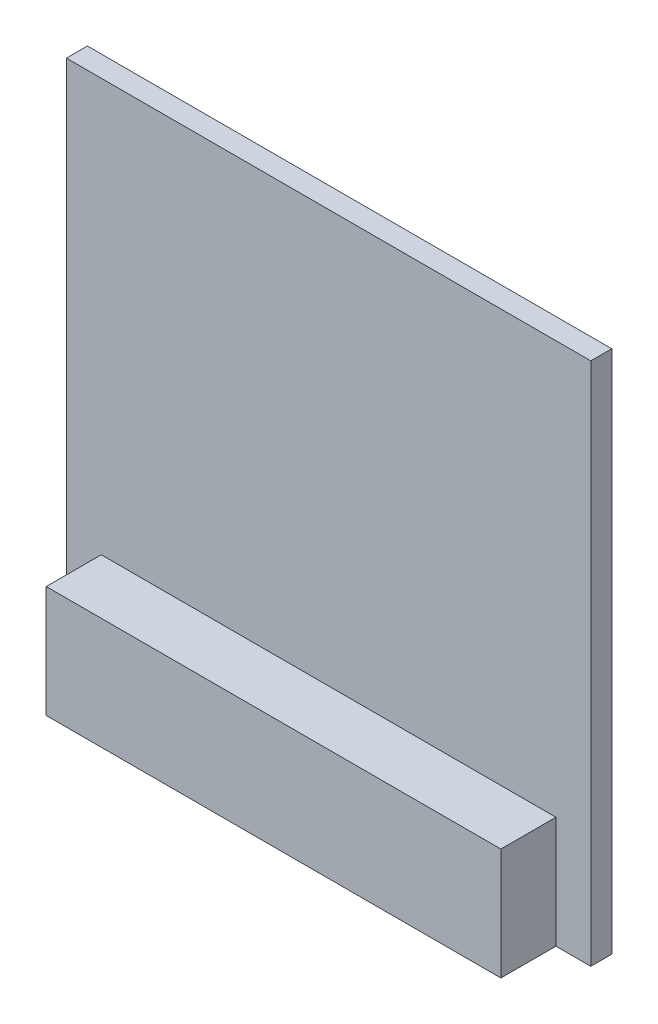
ISO-10303-21;
HEADER;
FILE_DESCRIPTION(('STEP AP214'),'2;1');
FILE_NAME('part.step','',(''),(''),'','','');
FILE_SCHEMA(('AUTOMOTIVE_DESIGN { 1 0 10303 214 1 1 1 1 }'));
ENDSEC;
DATA;
#1=APPLICATION_CONTEXT('core data for automotive mechanical design processes');
#2=APPLICATION_PROTOCOL_DEFINITION('international standard','automotive_design',2000,#1);
#3=PRODUCT_CONTEXT('',#1,'mechanical');
#4=PRODUCT('Part','Part','',(#3));
#5=PRODUCT_RELATED_PRODUCT_CATEGORY('part','',(#4));
#6=PRODUCT_DEFINITION_FORMATION('','',#4);
#7=PRODUCT_DEFINITION_CONTEXT('part definition',#1,'design');
#8=PRODUCT_DEFINITION('design','',#6,#7);
#9=PRODUCT_DEFINITION_SHAPE('','',#8);
#10=(LENGTH_UNIT() NAMED_UNIT(*) SI_UNIT(.MILLI.,.METRE.));
#11=(NAMED_UNIT(*) PLANE_ANGLE_UNIT() SI_UNIT($,.RADIAN.));
#12=(NAMED_UNIT(*) SI_UNIT($,.STERADIAN.) SOLID_ANGLE_UNIT());
#13=UNCERTAINTY_MEASURE_WITH_UNIT(LENGTH_MEASURE(1.E-05),#10,'distance_accuracy_value','');
#14=(GEOMETRIC_REPRESENTATION_CONTEXT(3) GLOBAL_UNCERTAINTY_ASSIGNED_CONTEXT((#13)) GLOBAL_UNIT_ASSIGNED_CONTEXT((#10,
#11,#12)) REPRESENTATION_CONTEXT('',''));
#15=CARTESIAN_POINT('',(0.,0.,0.));
#16=DIRECTION('',(0.,0.,1.));
#17=DIRECTION('',(1.,0.,0.));
#18=AXIS2_PLACEMENT_3D('',#15,#16,#17);
#19=CARTESIAN_POINT('',(0.,0.,0.));
#20=DIRECTION('',(0.,0.,-1.));
#21=DIRECTION('',(-1.,0.,0.));
#22=AXIS2_PLACEMENT_3D('',#19,#20,#21);
#23=PLANE('',#22);
#24=DIRECTION('',(0.,1.,0.));
#25=VECTOR('',#24,1.);
#26=CARTESIAN_POINT('',(12.7,-12.7,0.));
#27=LINE('',#26,#25);
#28=CARTESIAN_POINT('',(12.7,-12.7,0.));
#29=VERTEX_POINT('',#28);
#30=CARTESIAN_POINT('',(12.7,12.7,0.));
#31=VERTEX_POINT('',#30);
#32=EDGE_CURVE('E180',#29,#31,#27,.T.);
#33=ORIENTED_EDGE('',*,*,#32,.F.);
#34=DIRECTION('',(1.,0.,0.));
#35=VECTOR('',#34,1.);
#36=CARTESIAN_POINT('',(-12.7,-12.7,0.));
#37=LINE('',#36,#35);
#38=CARTESIAN_POINT('',(-12.7,-12.7,0.));
#39=VERTEX_POINT('',#38);
#40=EDGE_CURVE('E185',#39,#29,#37,.T.);
#41=ORIENTED_EDGE('',*,*,#40,.F.);
#42=DIRECTION('',(0.,-1.,0.));
#43=VECTOR('',#42,1.);
#44=CARTESIAN_POINT('',(-12.7,-12.7,0.));
#45=LINE('',#44,#43);
#46=CARTESIAN_POINT('',(-12.7,12.7,0.));
#47=VERTEX_POINT('',#46);
#48=EDGE_CURVE('E197',#47,#39,#45,.T.);
#49=ORIENTED_EDGE('',*,*,#48,.F.);
#50=DIRECTION('',(-1.,0.,0.));
#51=VECTOR('',#50,1.);
#52=CARTESIAN_POINT('',(-12.7,12.7,0.));
#53=LINE('',#52,#51);
#54=EDGE_CURVE('E195',#31,#47,#53,.T.);
#55=ORIENTED_EDGE('',*,*,#54,.F.);
#56=EDGE_LOOP('',(#33,#41,#49,#55));
#57=FACE_BOUND('',#56,.T.);
#58=DIRECTION('',(1.,0.,0.));
#59=VECTOR('',#58,1.);
#60=CARTESIAN_POINT('',(4.0132,0.508000000000007,0.));
#61=LINE('',#60,#59);
#62=CARTESIAN_POINT('',(-4.0132,0.508000000000007,0.));
#63=VERTEX_POINT('',#62);
#64=CARTESIAN_POINT('',(4.0132,0.508000000000007,0.));
#65=VERTEX_POINT('',#64);
#66=EDGE_CURVE('E363',#63,#65,#61,.T.);
#67=ORIENTED_EDGE('',*,*,#66,.F.);
#68=DIRECTION('',(0.,1.,0.));
#69=VECTOR('',#68,1.);
#70=CARTESIAN_POINT('',(-4.0132,-7.46759999999999,0.));
#71=LINE('',#70,#69);
#72=CARTESIAN_POINT('',(-4.0132,-7.46759999999999,0.));
#73=VERTEX_POINT('',#72);
#74=EDGE_CURVE('E147',#73,#63,#71,.T.);
#75=ORIENTED_EDGE('',*,*,#74,.F.);
#76=DIRECTION('',(-1.,0.,0.));
#77=VECTOR('',#76,1.);
#78=CARTESIAN_POINT('',(4.0132,-7.46759999999999,0.));
#79=LINE('',#78,#77);
#80=CARTESIAN_POINT('',(4.0132,-7.46759999999999,0.));
#81=VERTEX_POINT('',#80);
#82=EDGE_CURVE('E143',#81,#73,#79,.T.);
#83=ORIENTED_EDGE('',*,*,#82,.F.);
#84=DIRECTION('',(0.,-1.,0.));
#85=VECTOR('',#84,1.);
#86=CARTESIAN_POINT('',(4.0132,-7.46759999999999,0.));
#87=LINE('',#86,#85);
#88=EDGE_CURVE('E360',#65,#81,#87,.T.);
#89=ORIENTED_EDGE('',*,*,#88,.F.);
#90=EDGE_LOOP('',(#67,#75,#83,#89));
#91=FACE_BOUND('',#90,.T.);
#92=ADVANCED_FACE('F35',(#57,#91),#23,.T.);
#93=CARTESIAN_POINT('',(0.,0.,1.016));
#94=DIRECTION('',(0.,0.,-1.));
#95=DIRECTION('',(-1.,0.,0.));
#96=AXIS2_PLACEMENT_3D('',#93,#94,#95);
#97=PLANE('',#96);
#98=DIRECTION('',(0.,-1.,0.));
#99=VECTOR('',#98,1.);
#100=CARTESIAN_POINT('',(-11.0109,-12.7,1.016));
#101=LINE('',#100,#99);
#102=CARTESIAN_POINT('',(-11.0109,-7.2898,1.016));
#103=VERTEX_POINT('',#102);
#104=CARTESIAN_POINT('',(-11.0109,-12.7,1.016));
#105=VERTEX_POINT('',#104);
#106=EDGE_CURVE('E58',#103,#105,#101,.T.);
#107=ORIENTED_EDGE('',*,*,#106,.F.);
#108=DIRECTION('',(-1.,0.,0.));
#109=VECTOR('',#108,1.);
#110=CARTESIAN_POINT('',(-11.0109,-7.2898,1.016));
#111=LINE('',#110,#109);
#112=CARTESIAN_POINT('',(11.0109,-7.2898,1.016));
#113=VERTEX_POINT('',#112);
#114=EDGE_CURVE('E159',#113,#103,#111,.T.);
#115=ORIENTED_EDGE('',*,*,#114,.F.);
#116=DIRECTION('',(0.,1.,0.));
#117=VECTOR('',#116,1.);
#118=CARTESIAN_POINT('',(11.0109,-12.7,1.016));
#119=LINE('',#118,#117);
#120=CARTESIAN_POINT('',(11.0109,-12.7,1.016));
#121=VERTEX_POINT('',#120);
#122=EDGE_CURVE('E150',#121,#113,#119,.T.);
#123=ORIENTED_EDGE('',*,*,#122,.F.);
#124=DIRECTION('',(1.,0.,0.));
#125=VECTOR('',#124,1.);
#126=CARTESIAN_POINT('',(-12.7,-12.7,1.016));
#127=LINE('',#126,#125);
#128=CARTESIAN_POINT('',(12.7,-12.7,1.016));
#129=VERTEX_POINT('',#128);
#130=EDGE_CURVE('E189',#121,#129,#127,.T.);
#131=ORIENTED_EDGE('',*,*,#130,.T.);
#132=DIRECTION('',(0.,1.,0.));
#133=VECTOR('',#132,1.);
#134=CARTESIAN_POINT('',(12.7,-12.7,1.016));
#135=LINE('',#134,#133);
#136=CARTESIAN_POINT('',(12.7,12.7,1.016));
#137=VERTEX_POINT('',#136);
#138=EDGE_CURVE('E181',#129,#137,#135,.T.);
#139=ORIENTED_EDGE('',*,*,#138,.T.);
#140=DIRECTION('',(-1.,0.,0.));
#141=VECTOR('',#140,1.);
#142=CARTESIAN_POINT('',(-12.7,12.7,1.016));
#143=LINE('',#142,#141);
#144=CARTESIAN_POINT('',(-12.7,12.7,1.016));
#145=VERTEX_POINT('',#144);
#146=EDGE_CURVE('E184',#137,#145,#143,.T.);
#147=ORIENTED_EDGE('',*,*,#146,.T.);
#148=DIRECTION('',(0.,-1.,0.));
#149=VECTOR('',#148,1.);
#150=CARTESIAN_POINT('',(-12.7,-12.7,1.016));
#151=LINE('',#150,#149);
#152=CARTESIAN_POINT('',(-12.7,-12.7,1.016));
#153=VERTEX_POINT('',#152);
#154=EDGE_CURVE('E187',#145,#153,#151,.T.);
#155=ORIENTED_EDGE('',*,*,#154,.T.);
#156=EDGE_CURVE('E190',#153,#105,#127,.T.);
#157=ORIENTED_EDGE('',*,*,#156,.T.);
#158=EDGE_LOOP('',(#107,#115,#123,#131,#139,#147,#155,#157));
#159=FACE_BOUND('',#158,.T.);
#160=ADVANCED_FACE('F224',(#159),#97,.F.);
#161=CARTESIAN_POINT('',(12.7,-12.7,1.016));
#162=DIRECTION('',(-1.,0.,0.));
#163=DIRECTION('',(0.,0.,1.));
#164=AXIS2_PLACEMENT_3D('',#161,#162,#163);
#165=PLANE('',#164);
#166=ORIENTED_EDGE('',*,*,#32,.T.);
#167=DIRECTION('',(0.,0.,-1.));
#168=VECTOR('',#167,1.);
#169=CARTESIAN_POINT('',(12.7,12.7,1.016));
#170=LINE('',#169,#168);
#171=EDGE_CURVE('E11',#137,#31,#170,.T.);
#172=ORIENTED_EDGE('',*,*,#171,.F.);
#173=ORIENTED_EDGE('',*,*,#138,.F.);
#174=DIRECTION('',(0.,0.,-1.));
#175=VECTOR('',#174,1.);
#176=CARTESIAN_POINT('',(12.7,-12.7,1.016));
#177=LINE('',#176,#175);
#178=EDGE_CURVE('E192',#129,#29,#177,.T.);
#179=ORIENTED_EDGE('',*,*,#178,.T.);
#180=EDGE_LOOP('',(#166,#172,#173,#179));
#181=FACE_BOUND('',#180,.T.);
#182=ADVANCED_FACE('F37',(#181),#165,.F.);
#183=CARTESIAN_POINT('',(-12.7,12.7,1.016));
#184=DIRECTION('',(0.,-1.,0.));
#185=DIRECTION('',(0.,0.,-1.));
#186=AXIS2_PLACEMENT_3D('',#183,#184,#185);
#187=PLANE('',#186);
#188=ORIENTED_EDGE('',*,*,#54,.T.);
#189=DIRECTION('',(0.,0.,-1.));
#190=VECTOR('',#189,1.);
#191=CARTESIAN_POINT('',(-12.7,12.7,1.016));
#192=LINE('',#191,#190);
#193=EDGE_CURVE('E43',#145,#47,#192,.T.);
#194=ORIENTED_EDGE('',*,*,#193,.F.);
#195=ORIENTED_EDGE('',*,*,#146,.F.);
#196=ORIENTED_EDGE('',*,*,#171,.T.);
#197=EDGE_LOOP('',(#188,#194,#195,#196));
#198=FACE_BOUND('',#197,.T.);
#199=ADVANCED_FACE('F259',(#198),#187,.F.);
#200=CARTESIAN_POINT('',(-12.7,-12.7,1.016));
#201=DIRECTION('',(1.,0.,0.));
#202=DIRECTION('',(0.,0.,-1.));
#203=AXIS2_PLACEMENT_3D('',#200,#201,#202);
#204=PLANE('',#203);
#205=ORIENTED_EDGE('',*,*,#48,.T.);
#206=DIRECTION('',(0.,0.,-1.));
#207=VECTOR('',#206,1.);
#208=CARTESIAN_POINT('',(-12.7,-12.7,1.016));
#209=LINE('',#208,#207);
#210=EDGE_CURVE('E202',#153,#39,#209,.T.);
#211=ORIENTED_EDGE('',*,*,#210,.F.);
#212=ORIENTED_EDGE('',*,*,#154,.F.);
#213=ORIENTED_EDGE('',*,*,#193,.T.);
#214=EDGE_LOOP('',(#205,#211,#212,#213));
#215=FACE_BOUND('',#214,.T.);
#216=ADVANCED_FACE('F209',(#215),#204,.F.);
#217=CARTESIAN_POINT('',(-12.7,-12.7,1.016));
#218=DIRECTION('',(0.,1.,0.));
#219=DIRECTION('',(0.,0.,1.));
#220=AXIS2_PLACEMENT_3D('',#217,#218,#219);
#221=PLANE('',#220);
#222=ORIENTED_EDGE('',*,*,#40,.T.);
#223=ORIENTED_EDGE('',*,*,#178,.F.);
#224=ORIENTED_EDGE('',*,*,#130,.F.);
#225=DIRECTION('',(0.,0.,-1.));
#226=VECTOR('',#225,1.);
#227=CARTESIAN_POINT('',(11.0109,-12.7,3.683));
#228=LINE('',#227,#226);
#229=CARTESIAN_POINT('',(11.0109,-12.7,3.683));
#230=VERTEX_POINT('',#229);
#231=EDGE_CURVE('E174',#230,#121,#228,.T.);
#232=ORIENTED_EDGE('',*,*,#231,.F.);
#233=DIRECTION('',(1.,0.,0.));
#234=VECTOR('',#233,1.);
#235=CARTESIAN_POINT('',(-11.0109,-12.7,3.683));
#236=LINE('',#235,#234);
#237=CARTESIAN_POINT('',(-11.0109,-12.7,3.683));
#238=VERTEX_POINT('',#237);
#239=EDGE_CURVE('E158',#238,#230,#236,.T.);
#240=ORIENTED_EDGE('',*,*,#239,.F.);
#241=DIRECTION('',(0.,0.,-1.));
#242=VECTOR('',#241,1.);
#243=CARTESIAN_POINT('',(-11.0109,-12.7,3.683));
#244=LINE('',#243,#242);
#245=EDGE_CURVE('E177',#238,#105,#244,.T.);
#246=ORIENTED_EDGE('',*,*,#245,.T.);
#247=ORIENTED_EDGE('',*,*,#156,.F.);
#248=ORIENTED_EDGE('',*,*,#210,.T.);
#249=EDGE_LOOP('',(#222,#223,#224,#232,#240,#246,#247,#248));
#250=FACE_BOUND('',#249,.T.);
#251=ADVANCED_FACE('F218',(#250),#221,.F.);
#252=CARTESIAN_POINT('',(-11.0109,-12.7,3.683));
#253=DIRECTION('',(1.,0.,0.));
#254=DIRECTION('',(0.,0.,-1.));
#255=AXIS2_PLACEMENT_3D('',#252,#253,#254);
#256=PLANE('',#255);
#257=ORIENTED_EDGE('',*,*,#106,.T.);
#258=ORIENTED_EDGE('',*,*,#245,.F.);
#259=DIRECTION('',(0.,-1.,0.));
#260=VECTOR('',#259,1.);
#261=CARTESIAN_POINT('',(-11.0109,-12.7,3.683));
#262=LINE('',#261,#260);
#263=CARTESIAN_POINT('',(-11.0109,-7.2898,3.683));
#264=VERTEX_POINT('',#263);
#265=EDGE_CURVE('E155',#264,#238,#262,.T.);
#266=ORIENTED_EDGE('',*,*,#265,.F.);
#267=DIRECTION('',(0.,0.,-1.));
#268=VECTOR('',#267,1.);
#269=CARTESIAN_POINT('',(-11.0109,-7.2898,3.683));
#270=LINE('',#269,#268);
#271=EDGE_CURVE('E164',#264,#103,#270,.T.);
#272=ORIENTED_EDGE('',*,*,#271,.T.);
#273=EDGE_LOOP('',(#257,#258,#266,#272));
#274=FACE_BOUND('',#273,.T.);
#275=ADVANCED_FACE('F237',(#274),#256,.F.);
#276=CARTESIAN_POINT('',(11.0109,-12.7,3.683));
#277=DIRECTION('',(-1.,0.,0.));
#278=DIRECTION('',(0.,0.,1.));
#279=AXIS2_PLACEMENT_3D('',#276,#277,#278);
#280=PLANE('',#279);
#281=ORIENTED_EDGE('',*,*,#122,.T.);
#282=DIRECTION('',(0.,0.,-1.));
#283=VECTOR('',#282,1.);
#284=CARTESIAN_POINT('',(11.0109,-7.2898,3.683));
#285=LINE('',#284,#283);
#286=CARTESIAN_POINT('',(11.0109,-7.2898,3.683));
#287=VERTEX_POINT('',#286);
#288=EDGE_CURVE('E171',#287,#113,#285,.T.);
#289=ORIENTED_EDGE('',*,*,#288,.F.);
#290=DIRECTION('',(0.,1.,0.));
#291=VECTOR('',#290,1.);
#292=CARTESIAN_POINT('',(11.0109,-12.7,3.683));
#293=LINE('',#292,#291);
#294=EDGE_CURVE('E161',#230,#287,#293,.T.);
#295=ORIENTED_EDGE('',*,*,#294,.F.);
#296=ORIENTED_EDGE('',*,*,#231,.T.);
#297=EDGE_LOOP('',(#281,#289,#295,#296));
#298=FACE_BOUND('',#297,.T.);
#299=ADVANCED_FACE('F228',(#298),#280,.F.);
#300=CARTESIAN_POINT('',(-11.0109,-7.2898,3.683));
#301=DIRECTION('',(0.,-1.,0.));
#302=DIRECTION('',(0.,0.,-1.));
#303=AXIS2_PLACEMENT_3D('',#300,#301,#302);
#304=PLANE('',#303);
#305=ORIENTED_EDGE('',*,*,#114,.T.);
#306=ORIENTED_EDGE('',*,*,#271,.F.);
#307=DIRECTION('',(-1.,0.,0.));
#308=VECTOR('',#307,1.);
#309=CARTESIAN_POINT('',(-11.0109,-7.2898,3.683));
#310=LINE('',#309,#308);
#311=EDGE_CURVE('E163',#287,#264,#310,.T.);
#312=ORIENTED_EDGE('',*,*,#311,.F.);
#313=ORIENTED_EDGE('',*,*,#288,.T.);
#314=EDGE_LOOP('',(#305,#306,#312,#313));
#315=FACE_BOUND('',#314,.T.);
#316=ADVANCED_FACE('F239',(#315),#304,.F.);
#317=CARTESIAN_POINT('',(0.,0.,3.683));
#318=DIRECTION('',(0.,0.,-1.));
#319=DIRECTION('',(-1.,0.,0.));
#320=AXIS2_PLACEMENT_3D('',#317,#318,#319);
#321=PLANE('',#320);
#322=ORIENTED_EDGE('',*,*,#265,.T.);
#323=ORIENTED_EDGE('',*,*,#239,.T.);
#324=ORIENTED_EDGE('',*,*,#294,.T.);
#325=ORIENTED_EDGE('',*,*,#311,.T.);
#326=EDGE_LOOP('',(#322,#323,#324,#325));
#327=FACE_BOUND('',#326,.T.);
#328=ADVANCED_FACE('F232',(#327),#321,.F.);
#329=CARTESIAN_POINT('',(-4.0132,-7.46759999999999,-3.58902));
#330=DIRECTION('',(1.,0.,0.));
#331=DIRECTION('',(0.,0.,-1.));
#332=AXIS2_PLACEMENT_3D('',#329,#330,#331);
#333=PLANE('',#332);
#334=ORIENTED_EDGE('',*,*,#74,.T.);
#335=DIRECTION('',(0.,0.,1.));
#336=VECTOR('',#335,1.);
#337=CARTESIAN_POINT('',(-4.0132,0.508000000000007,-3.58902));
#338=LINE('',#337,#336);
#339=CARTESIAN_POINT('',(-4.0132,0.508000000000007,-3.58902));
#340=VERTEX_POINT('',#339);
#341=EDGE_CURVE('E128',#340,#63,#338,.T.);
#342=ORIENTED_EDGE('',*,*,#341,.F.);
#343=DIRECTION('',(0.,1.,0.));
#344=VECTOR('',#343,1.);
#345=CARTESIAN_POINT('',(-4.0132,-7.46759999999999,-3.58902));
#346=LINE('',#345,#344);
#347=CARTESIAN_POINT('',(-4.0132,-7.46759999999999,-3.58902));
#348=VERTEX_POINT('',#347);
#349=EDGE_CURVE('E135',#348,#340,#346,.T.);
#350=ORIENTED_EDGE('',*,*,#349,.F.);
#351=DIRECTION('',(0.,0.,1.));
#352=VECTOR('',#351,1.);
#353=CARTESIAN_POINT('',(-4.0132,-7.46759999999999,-3.58902));
#354=LINE('',#353,#352);
#355=EDGE_CURVE('E358',#348,#73,#354,.T.);
#356=ORIENTED_EDGE('',*,*,#355,.T.);
#357=EDGE_LOOP('',(#334,#342,#350,#356));
#358=FACE_BOUND('',#357,.T.);
#359=ADVANCED_FACE('F145',(#358),#333,.F.);
#360=CARTESIAN_POINT('',(4.0132,0.508000000000007,-3.58902));
#361=DIRECTION('',(0.,-1.,0.));
#362=DIRECTION('',(0.,0.,-1.));
#363=AXIS2_PLACEMENT_3D('',#360,#361,#362);
#364=PLANE('',#363);
#365=ORIENTED_EDGE('',*,*,#66,.T.);
#366=DIRECTION('',(0.,0.,1.));
#367=VECTOR('',#366,1.);
#368=CARTESIAN_POINT('',(4.0132,0.508000000000007,-3.58902));
#369=LINE('',#368,#367);
#370=CARTESIAN_POINT('',(4.0132,0.508000000000007,-3.58902));
#371=VERTEX_POINT('',#370);
#372=EDGE_CURVE('E131',#371,#65,#369,.T.);
#373=ORIENTED_EDGE('',*,*,#372,.F.);
#374=DIRECTION('',(1.,0.,0.));
#375=VECTOR('',#374,1.);
#376=CARTESIAN_POINT('',(4.0132,0.508000000000007,-3.58902));
#377=LINE('',#376,#375);
#378=EDGE_CURVE('E124',#340,#371,#377,.T.);
#379=ORIENTED_EDGE('',*,*,#378,.F.);
#380=ORIENTED_EDGE('',*,*,#341,.T.);
#381=EDGE_LOOP('',(#365,#373,#379,#380));
#382=FACE_BOUND('',#381,.T.);
#383=ADVANCED_FACE('F126',(#382),#364,.F.);
#384=CARTESIAN_POINT('',(4.0132,-7.46759999999999,-3.58902));
#385=DIRECTION('',(-1.,0.,0.));
#386=DIRECTION('',(0.,0.,1.));
#387=AXIS2_PLACEMENT_3D('',#384,#385,#386);
#388=PLANE('',#387);
#389=ORIENTED_EDGE('',*,*,#88,.T.);
#390=DIRECTION('',(0.,0.,1.));
#391=VECTOR('',#390,1.);
#392=CARTESIAN_POINT('',(4.0132,-7.46759999999999,-3.58902));
#393=LINE('',#392,#391);
#394=CARTESIAN_POINT('',(4.0132,-7.46759999999999,-3.58902));
#395=VERTEX_POINT('',#394);
#396=EDGE_CURVE('E50',#395,#81,#393,.T.);
#397=ORIENTED_EDGE('',*,*,#396,.F.);
#398=DIRECTION('',(0.,-1.,0.));
#399=VECTOR('',#398,1.);
#400=CARTESIAN_POINT('',(4.0132,-7.46759999999999,-3.58902));
#401=LINE('',#400,#399);
#402=EDGE_CURVE('E134',#371,#395,#401,.T.);
#403=ORIENTED_EDGE('',*,*,#402,.F.);
#404=ORIENTED_EDGE('',*,*,#372,.T.);
#405=EDGE_LOOP('',(#389,#397,#403,#404));
#406=FACE_BOUND('',#405,.T.);
#407=ADVANCED_FACE('F327',(#406),#388,.F.);
#408=CARTESIAN_POINT('',(4.0132,-7.46759999999999,-3.58902));
#409=DIRECTION('',(0.,1.,0.));
#410=DIRECTION('',(0.,0.,1.));
#411=AXIS2_PLACEMENT_3D('',#408,#409,#410);
#412=PLANE('',#411);
#413=ORIENTED_EDGE('',*,*,#82,.T.);
#414=ORIENTED_EDGE('',*,*,#355,.F.);
#415=DIRECTION('',(-1.,0.,0.));
#416=VECTOR('',#415,1.);
#417=CARTESIAN_POINT('',(4.0132,-7.46759999999999,-3.58902));
#418=LINE('',#417,#416);
#419=EDGE_CURVE('E139',#395,#348,#418,.T.);
#420=ORIENTED_EDGE('',*,*,#419,.F.);
#421=ORIENTED_EDGE('',*,*,#396,.T.);
#422=EDGE_LOOP('',(#413,#414,#420,#421));
#423=FACE_BOUND('',#422,.T.);
#424=ADVANCED_FACE('F336',(#423),#412,.F.);
#425=CARTESIAN_POINT('',(0.,0.,-3.58902));
#426=DIRECTION('',(0.,0.,1.));
#427=DIRECTION('',(1.,0.,0.));
#428=AXIS2_PLACEMENT_3D('',#425,#426,#427);
#429=PLANE('',#428);
#430=ORIENTED_EDGE('',*,*,#349,.T.);
#431=ORIENTED_EDGE('',*,*,#378,.T.);
#432=ORIENTED_EDGE('',*,*,#402,.T.);
#433=ORIENTED_EDGE('',*,*,#419,.T.);
#434=EDGE_LOOP('',(#430,#431,#432,#433));
#435=FACE_BOUND('',#434,.T.);
#436=ADVANCED_FACE('F138',(#435),#429,.F.);
#437=CLOSED_SHELL('',(#92,#160,#182,#199,#216,#251,#275,#299,#316,#328,#359,#383,#407,#424,#436));
#438=MANIFOLD_SOLID_BREP('B2',#437);
#439=ADVANCED_BREP_SHAPE_REPRESENTATION('',(#18,#438),#14);
#440=SHAPE_DEFINITION_REPRESENTATION(#9,#439);
ENDSEC;
END-ISO-10303-21;
